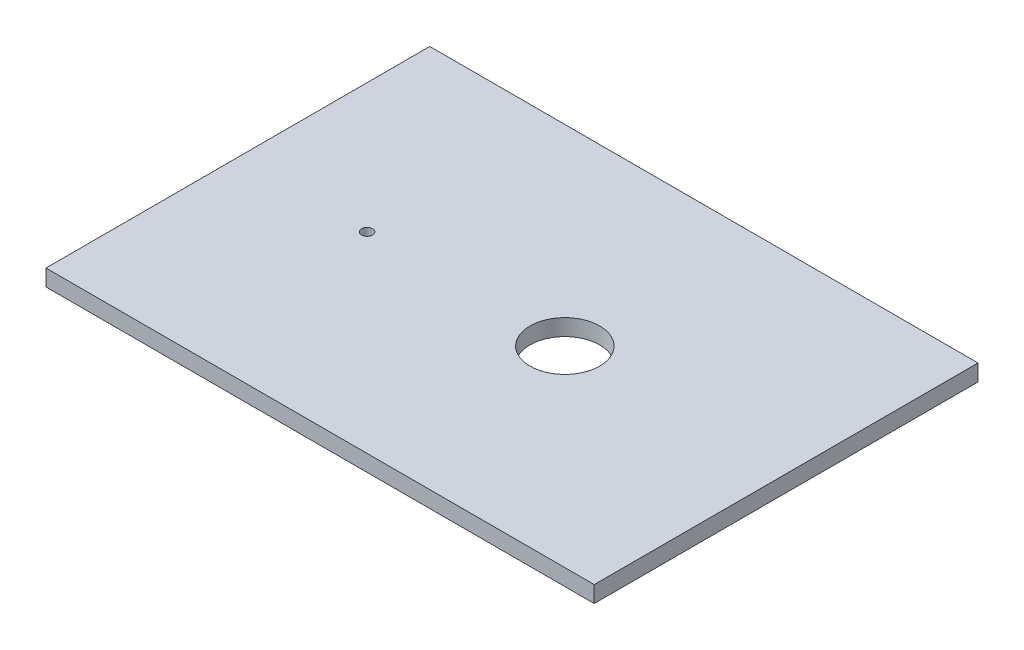
ISO-10303-21;
HEADER;
FILE_DESCRIPTION(('STEP AP214'),'2;1');
FILE_NAME('part.step','',(''),(''),'','','');
FILE_SCHEMA(('AUTOMOTIVE_DESIGN { 1 0 10303 214 1 1 1 1 }'));
ENDSEC;
DATA;
#1=APPLICATION_CONTEXT('core data for automotive mechanical design processes');
#2=APPLICATION_PROTOCOL_DEFINITION('international standard','automotive_design',2000,#1);
#3=PRODUCT_CONTEXT('',#1,'mechanical');
#4=PRODUCT('Part','Part','',(#3));
#5=PRODUCT_RELATED_PRODUCT_CATEGORY('part','',(#4));
#6=PRODUCT_DEFINITION_FORMATION('','',#4);
#7=PRODUCT_DEFINITION_CONTEXT('part definition',#1,'design');
#8=PRODUCT_DEFINITION('design','',#6,#7);
#9=PRODUCT_DEFINITION_SHAPE('','',#8);
#10=(LENGTH_UNIT() NAMED_UNIT(*) SI_UNIT(.MILLI.,.METRE.));
#11=(NAMED_UNIT(*) PLANE_ANGLE_UNIT() SI_UNIT($,.RADIAN.));
#12=(NAMED_UNIT(*) SI_UNIT($,.STERADIAN.) SOLID_ANGLE_UNIT());
#13=UNCERTAINTY_MEASURE_WITH_UNIT(LENGTH_MEASURE(1.E-05),#10,'distance_accuracy_value','');
#14=(GEOMETRIC_REPRESENTATION_CONTEXT(3) GLOBAL_UNCERTAINTY_ASSIGNED_CONTEXT((#13)) GLOBAL_UNIT_ASSIGNED_CONTEXT((#10,
#11,#12)) REPRESENTATION_CONTEXT('',''));
#15=CARTESIAN_POINT('',(0.,0.,0.));
#16=DIRECTION('',(0.,0.,1.));
#17=DIRECTION('',(1.,0.,0.));
#18=AXIS2_PLACEMENT_3D('',#15,#16,#17);
#19=CARTESIAN_POINT('',(50.,-3.,35.));
#20=DIRECTION('',(1.,0.,0.));
#21=DIRECTION('',(0.,0.,-1.));
#22=AXIS2_PLACEMENT_3D('',#19,#20,#21);
#23=PLANE('',#22);
#24=DIRECTION('',(0.,0.,-1.));
#25=VECTOR('',#24,1.);
#26=CARTESIAN_POINT('',(50.,0.,35.));
#27=LINE('',#26,#25);
#28=CARTESIAN_POINT('',(50.,0.,35.));
#29=VERTEX_POINT('',#28);
#30=CARTESIAN_POINT('',(50.,0.,-35.));
#31=VERTEX_POINT('',#30);
#32=EDGE_CURVE('E112',#29,#31,#27,.T.);
#33=ORIENTED_EDGE('',*,*,#32,.F.);
#34=DIRECTION('',(0.,1.,0.));
#35=VECTOR('',#34,1.);
#36=CARTESIAN_POINT('',(50.,-3.,35.));
#37=LINE('',#36,#35);
#38=CARTESIAN_POINT('',(50.,-3.,35.));
#39=VERTEX_POINT('',#38);
#40=EDGE_CURVE('E12',#39,#29,#37,.T.);
#41=ORIENTED_EDGE('',*,*,#40,.F.);
#42=DIRECTION('',(0.,0.,-1.));
#43=VECTOR('',#42,1.);
#44=CARTESIAN_POINT('',(50.,-3.,35.));
#45=LINE('',#44,#43);
#46=CARTESIAN_POINT('',(50.,-3.,-35.));
#47=VERTEX_POINT('',#46);
#48=EDGE_CURVE('E105',#39,#47,#45,.T.);
#49=ORIENTED_EDGE('',*,*,#48,.T.);
#50=DIRECTION('',(0.,1.,0.));
#51=VECTOR('',#50,1.);
#52=CARTESIAN_POINT('',(50.,-3.,-35.));
#53=LINE('',#52,#51);
#54=EDGE_CURVE('E50',#47,#31,#53,.T.);
#55=ORIENTED_EDGE('',*,*,#54,.T.);
#56=EDGE_LOOP('',(#33,#41,#49,#55));
#57=FACE_BOUND('',#56,.T.);
#58=ADVANCED_FACE('F47',(#57),#23,.T.);
#59=CARTESIAN_POINT('',(-50.,-3.,35.));
#60=DIRECTION('',(0.,0.,1.));
#61=DIRECTION('',(1.,0.,0.));
#62=AXIS2_PLACEMENT_3D('',#59,#60,#61);
#63=PLANE('',#62);
#64=DIRECTION('',(1.,0.,0.));
#65=VECTOR('',#64,1.);
#66=CARTESIAN_POINT('',(-50.,0.,35.));
#67=LINE('',#66,#65);
#68=CARTESIAN_POINT('',(-50.,0.,35.));
#69=VERTEX_POINT('',#68);
#70=EDGE_CURVE('E107',#69,#29,#67,.T.);
#71=ORIENTED_EDGE('',*,*,#70,.F.);
#72=DIRECTION('',(0.,1.,0.));
#73=VECTOR('',#72,1.);
#74=CARTESIAN_POINT('',(-50.,-3.,35.));
#75=LINE('',#74,#73);
#76=CARTESIAN_POINT('',(-50.,-3.,35.));
#77=VERTEX_POINT('',#76);
#78=EDGE_CURVE('E56',#77,#69,#75,.T.);
#79=ORIENTED_EDGE('',*,*,#78,.F.);
#80=DIRECTION('',(1.,0.,0.));
#81=VECTOR('',#80,1.);
#82=CARTESIAN_POINT('',(-50.,-3.,35.));
#83=LINE('',#82,#81);
#84=EDGE_CURVE('E102',#77,#39,#83,.T.);
#85=ORIENTED_EDGE('',*,*,#84,.T.);
#86=ORIENTED_EDGE('',*,*,#40,.T.);
#87=EDGE_LOOP('',(#71,#79,#85,#86));
#88=FACE_BOUND('',#87,.T.);
#89=ADVANCED_FACE('F123',(#88),#63,.T.);
#90=CARTESIAN_POINT('',(-50.,-3.,35.));
#91=DIRECTION('',(-1.,0.,0.));
#92=DIRECTION('',(0.,0.,1.));
#93=AXIS2_PLACEMENT_3D('',#90,#91,#92);
#94=PLANE('',#93);
#95=DIRECTION('',(0.,0.,1.));
#96=VECTOR('',#95,1.);
#97=CARTESIAN_POINT('',(-50.,0.,35.));
#98=LINE('',#97,#96);
#99=CARTESIAN_POINT('',(-50.,0.,-35.));
#100=VERTEX_POINT('',#99);
#101=EDGE_CURVE('E97',#100,#69,#98,.T.);
#102=ORIENTED_EDGE('',*,*,#101,.F.);
#103=DIRECTION('',(0.,1.,0.));
#104=VECTOR('',#103,1.);
#105=CARTESIAN_POINT('',(-50.,-3.,-35.));
#106=LINE('',#105,#104);
#107=CARTESIAN_POINT('',(-50.,-3.,-35.));
#108=VERTEX_POINT('',#107);
#109=EDGE_CURVE('E92',#108,#100,#106,.T.);
#110=ORIENTED_EDGE('',*,*,#109,.F.);
#111=DIRECTION('',(0.,0.,1.));
#112=VECTOR('',#111,1.);
#113=CARTESIAN_POINT('',(-50.,-3.,35.));
#114=LINE('',#113,#112);
#115=EDGE_CURVE('E95',#108,#77,#114,.T.);
#116=ORIENTED_EDGE('',*,*,#115,.T.);
#117=ORIENTED_EDGE('',*,*,#78,.T.);
#118=EDGE_LOOP('',(#102,#110,#116,#117));
#119=FACE_BOUND('',#118,.T.);
#120=ADVANCED_FACE('F94',(#119),#94,.T.);
#121=CARTESIAN_POINT('',(-50.,-3.,-35.));
#122=DIRECTION('',(0.,0.,-1.));
#123=DIRECTION('',(-1.,0.,0.));
#124=AXIS2_PLACEMENT_3D('',#121,#122,#123);
#125=PLANE('',#124);
#126=DIRECTION('',(-1.,0.,0.));
#127=VECTOR('',#126,1.);
#128=CARTESIAN_POINT('',(-50.,0.,-35.));
#129=LINE('',#128,#127);
#130=EDGE_CURVE('E115',#31,#100,#129,.T.);
#131=ORIENTED_EDGE('',*,*,#130,.F.);
#132=ORIENTED_EDGE('',*,*,#54,.F.);
#133=DIRECTION('',(-1.,0.,0.));
#134=VECTOR('',#133,1.);
#135=CARTESIAN_POINT('',(-50.,-3.,-35.));
#136=LINE('',#135,#134);
#137=EDGE_CURVE('E101',#47,#108,#136,.T.);
#138=ORIENTED_EDGE('',*,*,#137,.T.);
#139=ORIENTED_EDGE('',*,*,#109,.T.);
#140=EDGE_LOOP('',(#131,#132,#138,#139));
#141=FACE_BOUND('',#140,.T.);
#142=ADVANCED_FACE('F104',(#141),#125,.T.);
#143=CARTESIAN_POINT('',(0.,-3.,0.));
#144=DIRECTION('',(0.,-1.,0.));
#145=DIRECTION('',(0.,0.,-1.));
#146=AXIS2_PLACEMENT_3D('',#143,#144,#145);
#147=PLANE('',#146);
#148=CARTESIAN_POINT('',(9.64,-3.,0.));
#149=DIRECTION('',(0.,-1.,0.));
#150=DIRECTION('',(0.,0.,-1.));
#151=AXIS2_PLACEMENT_3D('',#148,#149,#150);
#152=CIRCLE('',#151,6.35);
#153=CARTESIAN_POINT('',(9.64,-3.,-6.35));
#154=VERTEX_POINT('',#153);
#155=EDGE_CURVE('E116',#154,#154,#152,.T.);
#156=ORIENTED_EDGE('',*,*,#155,.F.);
#157=EDGE_LOOP('',(#156));
#158=FACE_BOUND('',#157,.T.);
#159=CARTESIAN_POINT('',(-26.43,-3.,0.));
#160=DIRECTION('',(0.,-1.,0.));
#161=DIRECTION('',(0.,0.,-1.));
#162=AXIS2_PLACEMENT_3D('',#159,#160,#161);
#163=CIRCLE('',#162,1.);
#164=CARTESIAN_POINT('',(-26.43,-3.,-1.));
#165=VERTEX_POINT('',#164);
#166=EDGE_CURVE('E159',#165,#165,#163,.T.);
#167=ORIENTED_EDGE('',*,*,#166,.F.);
#168=EDGE_LOOP('',(#167));
#169=FACE_BOUND('',#168,.T.);
#170=ORIENTED_EDGE('',*,*,#48,.F.);
#171=ORIENTED_EDGE('',*,*,#84,.F.);
#172=ORIENTED_EDGE('',*,*,#115,.F.);
#173=ORIENTED_EDGE('',*,*,#137,.F.);
#174=EDGE_LOOP('',(#170,#171,#172,#173));
#175=FACE_BOUND('',#174,.T.);
#176=ADVANCED_FACE('F100',(#158,#169,#175),#147,.T.);
#177=CARTESIAN_POINT('',(0.,0.,0.));
#178=DIRECTION('',(0.,-1.,0.));
#179=DIRECTION('',(0.,0.,-1.));
#180=AXIS2_PLACEMENT_3D('',#177,#178,#179);
#181=PLANE('',#180);
#182=CARTESIAN_POINT('',(9.64,0.,0.));
#183=DIRECTION('',(0.,1.,0.));
#184=DIRECTION('',(0.,0.,1.));
#185=AXIS2_PLACEMENT_3D('',#182,#183,#184);
#186=CIRCLE('',#185,6.35);
#187=CARTESIAN_POINT('',(9.64,0.,6.35));
#188=VERTEX_POINT('',#187);
#189=EDGE_CURVE('E158',#188,#188,#186,.T.);
#190=ORIENTED_EDGE('',*,*,#189,.F.);
#191=EDGE_LOOP('',(#190));
#192=FACE_BOUND('',#191,.T.);
#193=CARTESIAN_POINT('',(-26.43,0.,0.));
#194=DIRECTION('',(0.,1.,0.));
#195=DIRECTION('',(0.,0.,1.));
#196=AXIS2_PLACEMENT_3D('',#193,#194,#195);
#197=CIRCLE('',#196,1.);
#198=CARTESIAN_POINT('',(-26.43,0.,1.));
#199=VERTEX_POINT('',#198);
#200=EDGE_CURVE('E160',#199,#199,#197,.T.);
#201=ORIENTED_EDGE('',*,*,#200,.F.);
#202=EDGE_LOOP('',(#201));
#203=FACE_BOUND('',#202,.T.);
#204=ORIENTED_EDGE('',*,*,#32,.T.);
#205=ORIENTED_EDGE('',*,*,#130,.T.);
#206=ORIENTED_EDGE('',*,*,#101,.T.);
#207=ORIENTED_EDGE('',*,*,#70,.T.);
#208=EDGE_LOOP('',(#204,#205,#206,#207));
#209=FACE_BOUND('',#208,.T.);
#210=ADVANCED_FACE('F122',(#192,#203,#209),#181,.F.);
#211=CARTESIAN_POINT('',(-26.43,-10.,0.));
#212=DIRECTION('',(0.,1.,0.));
#213=DIRECTION('',(0.,0.,1.));
#214=AXIS2_PLACEMENT_3D('',#211,#212,#213);
#215=CYLINDRICAL_SURFACE('',#214,1.);
#216=ORIENTED_EDGE('',*,*,#166,.T.);
#217=EDGE_LOOP('',(#216));
#218=FACE_BOUND('',#217,.T.);
#219=ORIENTED_EDGE('',*,*,#200,.T.);
#220=EDGE_LOOP('',(#219));
#221=FACE_BOUND('',#220,.T.);
#222=ADVANCED_FACE('F141',(#218,#221),#215,.F.);
#223=CARTESIAN_POINT('',(9.64,-10.,0.));
#224=DIRECTION('',(0.,1.,0.));
#225=DIRECTION('',(0.,0.,1.));
#226=AXIS2_PLACEMENT_3D('',#223,#224,#225);
#227=CYLINDRICAL_SURFACE('',#226,6.35);
#228=ORIENTED_EDGE('',*,*,#155,.T.);
#229=EDGE_LOOP('',(#228));
#230=FACE_BOUND('',#229,.T.);
#231=ORIENTED_EDGE('',*,*,#189,.T.);
#232=EDGE_LOOP('',(#231));
#233=FACE_BOUND('',#232,.T.);
#234=ADVANCED_FACE('F148',(#230,#233),#227,.F.);
#235=CLOSED_SHELL('',(#58,#89,#120,#142,#176,#210,#222,#234));
#236=MANIFOLD_SOLID_BREP('B2',#235);
#237=ADVANCED_BREP_SHAPE_REPRESENTATION('',(#18,#236),#14);
#238=SHAPE_DEFINITION_REPRESENTATION(#9,#237);
ENDSEC;
END-ISO-10303-21;
